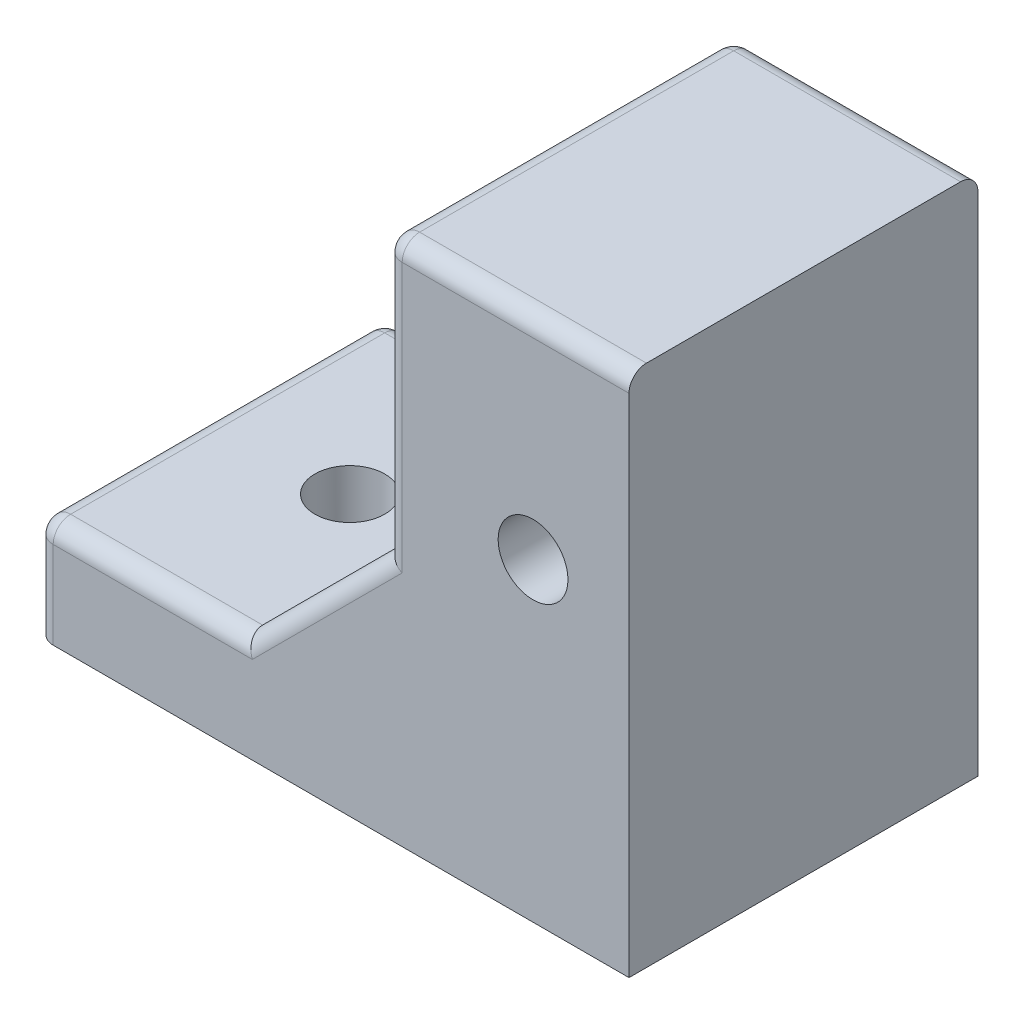
ISO-10303-21;
HEADER;
FILE_DESCRIPTION(('STEP AP214'),'2;1');
FILE_NAME('part.step','',(''),(''),'','','');
FILE_SCHEMA(('AUTOMOTIVE_DESIGN { 1 0 10303 214 1 1 1 1 }'));
ENDSEC;
DATA;
#1=APPLICATION_CONTEXT('core data for automotive mechanical design processes');
#2=APPLICATION_PROTOCOL_DEFINITION('international standard','automotive_design',2000,#1);
#3=PRODUCT_CONTEXT('',#1,'mechanical');
#4=PRODUCT('Part','Part','',(#3));
#5=PRODUCT_RELATED_PRODUCT_CATEGORY('part','',(#4));
#6=PRODUCT_DEFINITION_FORMATION('','',#4);
#7=PRODUCT_DEFINITION_CONTEXT('part definition',#1,'design');
#8=PRODUCT_DEFINITION('design','',#6,#7);
#9=PRODUCT_DEFINITION_SHAPE('','',#8);
#10=(LENGTH_UNIT() NAMED_UNIT(*) SI_UNIT(.MILLI.,.METRE.));
#11=(NAMED_UNIT(*) PLANE_ANGLE_UNIT() SI_UNIT($,.RADIAN.));
#12=(NAMED_UNIT(*) SI_UNIT($,.STERADIAN.) SOLID_ANGLE_UNIT());
#13=UNCERTAINTY_MEASURE_WITH_UNIT(LENGTH_MEASURE(1.E-05),#10,'distance_accuracy_value','');
#14=(GEOMETRIC_REPRESENTATION_CONTEXT(3) GLOBAL_UNCERTAINTY_ASSIGNED_CONTEXT((#13)) GLOBAL_UNIT_ASSIGNED_CONTEXT((#10,
#11,#12)) REPRESENTATION_CONTEXT('',''));
#15=CARTESIAN_POINT('',(0.,0.,0.));
#16=DIRECTION('',(0.,0.,1.));
#17=DIRECTION('',(1.,0.,0.));
#18=AXIS2_PLACEMENT_3D('',#15,#16,#17);
#19=CARTESIAN_POINT('',(-3.5,15.,-5.));
#20=DIRECTION('',(1.,0.,0.));
#21=DIRECTION('',(0.,0.,-1.));
#22=AXIS2_PLACEMENT_3D('',#19,#20,#21);
#23=PLANE('',#22);
#24=DIRECTION('',(0.,0.,1.));
#25=VECTOR('',#24,1.);
#26=CARTESIAN_POINT('',(-3.5,14.5,-5.));
#27=LINE('',#26,#25);
#28=CARTESIAN_POINT('',(-3.5,14.5,4.5));
#29=VERTEX_POINT('',#28);
#30=CARTESIAN_POINT('',(-3.5,14.5,-4.5));
#31=VERTEX_POINT('',#30);
#32=EDGE_CURVE('E252',#29,#31,#27,.F.);
#33=ORIENTED_EDGE('',*,*,#32,.T.);
#34=DIRECTION('',(0.,-1.,0.));
#35=VECTOR('',#34,1.);
#36=CARTESIAN_POINT('',(-3.5,6.99999999999996,-4.5));
#37=LINE('',#36,#35);
#38=CARTESIAN_POINT('',(-3.5,6.99999999999996,-4.5));
#39=VERTEX_POINT('',#38);
#40=EDGE_CURVE('E256',#31,#39,#37,.T.);
#41=ORIENTED_EDGE('',*,*,#40,.T.);
#42=DIRECTION('',(0.,0.,-1.));
#43=VECTOR('',#42,1.);
#44=CARTESIAN_POINT('',(-3.5,6.99999999999996,-3.));
#45=LINE('',#44,#43);
#46=CARTESIAN_POINT('',(-3.5,6.99999999999996,-3.));
#47=VERTEX_POINT('',#46);
#48=EDGE_CURVE('E173',#47,#39,#45,.T.);
#49=ORIENTED_EDGE('',*,*,#48,.F.);
#50=DIRECTION('',(0.,1.,0.));
#51=VECTOR('',#50,1.);
#52=CARTESIAN_POINT('',(-3.5,6.99999999999996,-3.));
#53=LINE('',#52,#51);
#54=CARTESIAN_POINT('',(-3.5,3.,-3.));
#55=VERTEX_POINT('',#54);
#56=EDGE_CURVE('E162',#55,#47,#53,.T.);
#57=ORIENTED_EDGE('',*,*,#56,.F.);
#58=DIRECTION('',(0.,0.,-1.));
#59=VECTOR('',#58,1.);
#60=CARTESIAN_POINT('',(-3.5,3.,-5.));
#61=LINE('',#60,#59);
#62=CARTESIAN_POINT('',(-3.5,3.,3.));
#63=VERTEX_POINT('',#62);
#64=EDGE_CURVE('E178',#63,#55,#61,.T.);
#65=ORIENTED_EDGE('',*,*,#64,.F.);
#66=DIRECTION('',(0.,1.,0.));
#67=VECTOR('',#66,1.);
#68=CARTESIAN_POINT('',(-3.5,6.99999999999996,3.));
#69=LINE('',#68,#67);
#70=CARTESIAN_POINT('',(-3.5,6.99999999999996,3.));
#71=VERTEX_POINT('',#70);
#72=EDGE_CURVE('E190',#63,#71,#69,.T.);
#73=ORIENTED_EDGE('',*,*,#72,.T.);
#74=DIRECTION('',(0.,0.,1.));
#75=VECTOR('',#74,1.);
#76=CARTESIAN_POINT('',(-3.5,6.99999999999996,3.));
#77=LINE('',#76,#75);
#78=CARTESIAN_POINT('',(-3.5,6.99999999999996,4.5));
#79=VERTEX_POINT('',#78);
#80=EDGE_CURVE('E195',#71,#79,#77,.T.);
#81=ORIENTED_EDGE('',*,*,#80,.T.);
#82=DIRECTION('',(0.,-1.,0.));
#83=VECTOR('',#82,1.);
#84=CARTESIAN_POINT('',(-3.5,15.,4.5));
#85=LINE('',#84,#83);
#86=EDGE_CURVE('E254',#79,#29,#85,.F.);
#87=ORIENTED_EDGE('',*,*,#86,.T.);
#88=EDGE_LOOP('',(#33,#41,#49,#57,#65,#73,#81,#87));
#89=FACE_BOUND('',#88,.T.);
#90=ADVANCED_FACE('F33',(#89),#23,.F.);
#91=CARTESIAN_POINT('',(-13.5,3.,-5.));
#92=DIRECTION('',(0.,-1.,0.));
#93=DIRECTION('',(0.,0.,-1.));
#94=AXIS2_PLACEMENT_3D('',#91,#92,#93);
#95=PLANE('',#94);
#96=CARTESIAN_POINT('',(-9.5,3.,0.));
#97=DIRECTION('',(0.,-1.,0.));
#98=DIRECTION('',(0.,0.,-1.));
#99=AXIS2_PLACEMENT_3D('',#96,#97,#98);
#100=CIRCLE('',#99,1.);
#101=CARTESIAN_POINT('',(-9.5,3.,-1.));
#102=VERTEX_POINT('',#101);
#103=EDGE_CURVE('E179',#102,#102,#100,.T.);
#104=ORIENTED_EDGE('',*,*,#103,.T.);
#105=EDGE_LOOP('',(#104));
#106=FACE_BOUND('',#105,.T.);
#107=DIRECTION('',(0.,0.,-1.));
#108=VECTOR('',#107,1.);
#109=CARTESIAN_POINT('',(-7.5,3.,-3.));
#110=LINE('',#109,#108);
#111=CARTESIAN_POINT('',(-7.5,3.,-3.));
#112=VERTEX_POINT('',#111);
#113=CARTESIAN_POINT('',(-7.5,3.,-4.5));
#114=VERTEX_POINT('',#113);
#115=EDGE_CURVE('E168',#112,#114,#110,.T.);
#116=ORIENTED_EDGE('',*,*,#115,.T.);
#117=DIRECTION('',(1.,0.,0.));
#118=VECTOR('',#117,1.);
#119=CARTESIAN_POINT('',(-13.5,3.,-4.5));
#120=LINE('',#119,#118);
#121=CARTESIAN_POINT('',(-13.,3.,-4.5));
#122=VERTEX_POINT('',#121);
#123=EDGE_CURVE('E264',#114,#122,#120,.F.);
#124=ORIENTED_EDGE('',*,*,#123,.T.);
#125=DIRECTION('',(0.,0.,-1.));
#126=VECTOR('',#125,1.);
#127=CARTESIAN_POINT('',(-13.,3.,-5.));
#128=LINE('',#127,#126);
#129=CARTESIAN_POINT('',(-13.,3.,4.5));
#130=VERTEX_POINT('',#129);
#131=EDGE_CURVE('E262',#122,#130,#128,.F.);
#132=ORIENTED_EDGE('',*,*,#131,.T.);
#133=DIRECTION('',(1.,0.,0.));
#134=VECTOR('',#133,1.);
#135=CARTESIAN_POINT('',(-13.5,3.,4.5));
#136=LINE('',#135,#134);
#137=CARTESIAN_POINT('',(-7.5,3.,4.5));
#138=VERTEX_POINT('',#137);
#139=EDGE_CURVE('E260',#130,#138,#136,.T.);
#140=ORIENTED_EDGE('',*,*,#139,.T.);
#141=DIRECTION('',(0.,0.,1.));
#142=VECTOR('',#141,1.);
#143=CARTESIAN_POINT('',(-7.5,3.,3.));
#144=LINE('',#143,#142);
#145=CARTESIAN_POINT('',(-7.5,3.,3.));
#146=VERTEX_POINT('',#145);
#147=EDGE_CURVE('E196',#146,#138,#144,.T.);
#148=ORIENTED_EDGE('',*,*,#147,.F.);
#149=DIRECTION('',(1.,0.,0.));
#150=VECTOR('',#149,1.);
#151=CARTESIAN_POINT('',(-3.5,3.,3.));
#152=LINE('',#151,#150);
#153=EDGE_CURVE('E187',#146,#63,#152,.T.);
#154=ORIENTED_EDGE('',*,*,#153,.T.);
#155=ORIENTED_EDGE('',*,*,#64,.T.);
#156=DIRECTION('',(1.,0.,0.));
#157=VECTOR('',#156,1.);
#158=CARTESIAN_POINT('',(-3.5,3.,-3.));
#159=LINE('',#158,#157);
#160=EDGE_CURVE('E160',#112,#55,#159,.T.);
#161=ORIENTED_EDGE('',*,*,#160,.F.);
#162=EDGE_LOOP('',(#116,#124,#132,#140,#148,#154,#155,#161));
#163=FACE_BOUND('',#162,.T.);
#164=ADVANCED_FACE('F176',(#106,#163),#95,.F.);
#165=CARTESIAN_POINT('',(-3.5,15.,5.));
#166=DIRECTION('',(0.,0.,-1.));
#167=DIRECTION('',(-1.,0.,0.));
#168=AXIS2_PLACEMENT_3D('',#165,#166,#167);
#169=PLANE('',#168);
#170=CARTESIAN_POINT('',(0.750000000000001,9.,5.));
#171=DIRECTION('',(0.,0.,-1.));
#172=DIRECTION('',(-1.,0.,0.));
#173=AXIS2_PLACEMENT_3D('',#170,#171,#172);
#174=CIRCLE('',#173,1.);
#175=CARTESIAN_POINT('',(-0.25,9.,5.));
#176=VERTEX_POINT('',#175);
#177=EDGE_CURVE('E326',#176,#176,#174,.T.);
#178=ORIENTED_EDGE('',*,*,#177,.T.);
#179=EDGE_LOOP('',(#178));
#180=FACE_BOUND('',#179,.T.);
#181=DIRECTION('',(1.,0.,0.));
#182=VECTOR('',#181,1.);
#183=CARTESIAN_POINT('',(-3.5,2.5,5.));
#184=LINE('',#183,#182);
#185=CARTESIAN_POINT('',(-7.29289321881345,2.5,5.));
#186=VERTEX_POINT('',#185);
#187=CARTESIAN_POINT('',(-13.,2.5,5.));
#188=VERTEX_POINT('',#187);
#189=EDGE_CURVE('E234',#186,#188,#184,.F.);
#190=ORIENTED_EDGE('',*,*,#189,.T.);
#191=DIRECTION('',(0.,1.,0.));
#192=VECTOR('',#191,1.);
#193=CARTESIAN_POINT('',(-13.,15.,5.));
#194=LINE('',#193,#192);
#195=CARTESIAN_POINT('',(-13.,0.,5.));
#196=VERTEX_POINT('',#195);
#197=EDGE_CURVE('E236',#188,#196,#194,.F.);
#198=ORIENTED_EDGE('',*,*,#197,.T.);
#199=DIRECTION('',(1.,0.,0.));
#200=VECTOR('',#199,1.);
#201=CARTESIAN_POINT('',(-3.5,0.,5.));
#202=LINE('',#201,#200);
#203=CARTESIAN_POINT('',(3.5,0.,5.));
#204=VERTEX_POINT('',#203);
#205=EDGE_CURVE('E204',#196,#204,#202,.T.);
#206=ORIENTED_EDGE('',*,*,#205,.T.);
#207=DIRECTION('',(0.,-1.,0.));
#208=VECTOR('',#207,1.);
#209=CARTESIAN_POINT('',(3.5,15.,5.));
#210=LINE('',#209,#208);
#211=CARTESIAN_POINT('',(3.5,14.5,5.));
#212=VERTEX_POINT('',#211);
#213=EDGE_CURVE('E219',#212,#204,#210,.T.);
#214=ORIENTED_EDGE('',*,*,#213,.F.);
#215=DIRECTION('',(1.,0.,0.));
#216=VECTOR('',#215,1.);
#217=CARTESIAN_POINT('',(-3.5,14.5,5.));
#218=LINE('',#217,#216);
#219=CARTESIAN_POINT('',(-3.,14.5,5.));
#220=VERTEX_POINT('',#219);
#221=EDGE_CURVE('E228',#212,#220,#218,.F.);
#222=ORIENTED_EDGE('',*,*,#221,.T.);
#223=DIRECTION('',(0.,-1.,0.));
#224=VECTOR('',#223,1.);
#225=CARTESIAN_POINT('',(-3.,15.,5.));
#226=LINE('',#225,#224);
#227=CARTESIAN_POINT('',(-3.,6.79289321881341,5.));
#228=VERTEX_POINT('',#227);
#229=EDGE_CURVE('E230',#220,#228,#226,.T.);
#230=ORIENTED_EDGE('',*,*,#229,.T.);
#231=DIRECTION('',(-0.707106781186551,-0.707106781186544,0.));
#232=VECTOR('',#231,1.);
#233=CARTESIAN_POINT('',(-7.14644660940673,2.64644660940672,5.));
#234=LINE('',#233,#232);
#235=EDGE_CURVE('E232',#228,#186,#234,.T.);
#236=ORIENTED_EDGE('',*,*,#235,.T.);
#237=EDGE_LOOP('',(#190,#198,#206,#214,#222,#230,#236));
#238=FACE_BOUND('',#237,.T.);
#239=ADVANCED_FACE('F346',(#180,#238),#169,.F.);
#240=CARTESIAN_POINT('',(3.5,15.,-5.));
#241=DIRECTION('',(1.,0.,0.));
#242=DIRECTION('',(0.,0.,-1.));
#243=AXIS2_PLACEMENT_3D('',#240,#241,#242);
#244=PLANE('',#243);
#245=DIRECTION('',(0.,-1.,0.));
#246=VECTOR('',#245,1.);
#247=CARTESIAN_POINT('',(3.5,15.,-5.));
#248=LINE('',#247,#246);
#249=CARTESIAN_POINT('',(3.5,14.5,-5.));
#250=VERTEX_POINT('',#249);
#251=CARTESIAN_POINT('',(3.5,0.,-5.));
#252=VERTEX_POINT('',#251);
#253=EDGE_CURVE('E209',#250,#252,#248,.T.);
#254=ORIENTED_EDGE('',*,*,#253,.F.);
#255=CARTESIAN_POINT('',(3.5,14.5,-4.5));
#256=DIRECTION('',(1.,0.,0.));
#257=DIRECTION('',(0.,0.,-1.));
#258=AXIS2_PLACEMENT_3D('',#255,#256,#257);
#259=CIRCLE('',#258,0.5);
#260=CARTESIAN_POINT('',(3.5,15.,-4.5));
#261=VERTEX_POINT('',#260);
#262=EDGE_CURVE('E270',#250,#261,#259,.T.);
#263=ORIENTED_EDGE('',*,*,#262,.T.);
#264=DIRECTION('',(0.,0.,1.));
#265=VECTOR('',#264,1.);
#266=CARTESIAN_POINT('',(3.5,15.,-5.));
#267=LINE('',#266,#265);
#268=CARTESIAN_POINT('',(3.5,15.,4.5));
#269=VERTEX_POINT('',#268);
#270=EDGE_CURVE('E206',#261,#269,#267,.T.);
#271=ORIENTED_EDGE('',*,*,#270,.T.);
#272=CARTESIAN_POINT('',(3.5,14.5,4.5));
#273=DIRECTION('',(1.,0.,0.));
#274=DIRECTION('',(0.,0.,-1.));
#275=AXIS2_PLACEMENT_3D('',#272,#273,#274);
#276=CIRCLE('',#275,0.5);
#277=EDGE_CURVE('E268',#269,#212,#276,.T.);
#278=ORIENTED_EDGE('',*,*,#277,.T.);
#279=ORIENTED_EDGE('',*,*,#213,.T.);
#280=DIRECTION('',(0.,0.,1.));
#281=VECTOR('',#280,1.);
#282=CARTESIAN_POINT('',(3.5,0.,-5.));
#283=LINE('',#282,#281);
#284=EDGE_CURVE('E213',#252,#204,#283,.T.);
#285=ORIENTED_EDGE('',*,*,#284,.F.);
#286=EDGE_LOOP('',(#254,#263,#271,#278,#279,#285));
#287=FACE_BOUND('',#286,.T.);
#288=ADVANCED_FACE('F352',(#287),#244,.T.);
#289=CARTESIAN_POINT('',(-3.5,15.,-5.));
#290=DIRECTION('',(0.,0.,-1.));
#291=DIRECTION('',(-1.,0.,0.));
#292=AXIS2_PLACEMENT_3D('',#289,#290,#291);
#293=PLANE('',#292);
#294=CARTESIAN_POINT('',(0.750000000000001,9.,-5.));
#295=DIRECTION('',(0.,0.,1.));
#296=DIRECTION('',(1.,0.,0.));
#297=AXIS2_PLACEMENT_3D('',#294,#295,#296);
#298=CIRCLE('',#297,1.);
#299=CARTESIAN_POINT('',(1.75,9.,-5.));
#300=VERTEX_POINT('',#299);
#301=EDGE_CURVE('E322',#300,#300,#298,.T.);
#302=ORIENTED_EDGE('',*,*,#301,.T.);
#303=EDGE_LOOP('',(#302));
#304=FACE_BOUND('',#303,.T.);
#305=DIRECTION('',(1.,0.,0.));
#306=VECTOR('',#305,1.);
#307=CARTESIAN_POINT('',(-3.5,0.,-5.));
#308=LINE('',#307,#306);
#309=CARTESIAN_POINT('',(-13.,0.,-5.));
#310=VERTEX_POINT('',#309);
#311=EDGE_CURVE('E210',#310,#252,#308,.T.);
#312=ORIENTED_EDGE('',*,*,#311,.F.);
#313=DIRECTION('',(0.,-1.,0.));
#314=VECTOR('',#313,1.);
#315=CARTESIAN_POINT('',(-13.,3.,-5.));
#316=LINE('',#315,#314);
#317=CARTESIAN_POINT('',(-13.,2.5,-5.));
#318=VERTEX_POINT('',#317);
#319=EDGE_CURVE('E250',#310,#318,#316,.F.);
#320=ORIENTED_EDGE('',*,*,#319,.T.);
#321=DIRECTION('',(1.,0.,0.));
#322=VECTOR('',#321,1.);
#323=CARTESIAN_POINT('',(-7.5,2.5,-5.));
#324=LINE('',#323,#322);
#325=CARTESIAN_POINT('',(-7.29289321881345,2.5,-5.));
#326=VERTEX_POINT('',#325);
#327=EDGE_CURVE('E248',#318,#326,#324,.T.);
#328=ORIENTED_EDGE('',*,*,#327,.T.);
#329=DIRECTION('',(-0.707106781186551,-0.707106781186544,0.));
#330=VECTOR('',#329,1.);
#331=CARTESIAN_POINT('',(-3.14644660940673,6.64644660940668,-5.));
#332=LINE('',#331,#330);
#333=CARTESIAN_POINT('',(-3.,6.79289321881341,-5.));
#334=VERTEX_POINT('',#333);
#335=EDGE_CURVE('E246',#326,#334,#332,.F.);
#336=ORIENTED_EDGE('',*,*,#335,.T.);
#337=DIRECTION('',(0.,-1.,0.));
#338=VECTOR('',#337,1.);
#339=CARTESIAN_POINT('',(-3.,15.,-5.));
#340=LINE('',#339,#338);
#341=CARTESIAN_POINT('',(-3.,14.5,-5.));
#342=VERTEX_POINT('',#341);
#343=EDGE_CURVE('E244',#334,#342,#340,.F.);
#344=ORIENTED_EDGE('',*,*,#343,.T.);
#345=DIRECTION('',(1.,0.,0.));
#346=VECTOR('',#345,1.);
#347=CARTESIAN_POINT('',(-3.5,14.5,-5.));
#348=LINE('',#347,#346);
#349=EDGE_CURVE('E242',#342,#250,#348,.T.);
#350=ORIENTED_EDGE('',*,*,#349,.T.);
#351=ORIENTED_EDGE('',*,*,#253,.T.);
#352=EDGE_LOOP('',(#312,#320,#328,#336,#344,#350,#351));
#353=FACE_BOUND('',#352,.T.);
#354=ADVANCED_FACE('F364',(#304,#353),#293,.T.);
#355=CARTESIAN_POINT('',(0.,15.,0.));
#356=DIRECTION('',(0.,1.,0.));
#357=DIRECTION('',(0.,0.,1.));
#358=AXIS2_PLACEMENT_3D('',#355,#356,#357);
#359=PLANE('',#358);
#360=ORIENTED_EDGE('',*,*,#270,.F.);
#361=DIRECTION('',(1.,0.,0.));
#362=VECTOR('',#361,1.);
#363=CARTESIAN_POINT('',(0.,15.,-4.5));
#364=LINE('',#363,#362);
#365=CARTESIAN_POINT('',(-3.,15.,-4.5));
#366=VERTEX_POINT('',#365);
#367=EDGE_CURVE('E11',#261,#366,#364,.F.);
#368=ORIENTED_EDGE('',*,*,#367,.T.);
#369=DIRECTION('',(0.,0.,1.));
#370=VECTOR('',#369,1.);
#371=CARTESIAN_POINT('',(-3.,15.,5.));
#372=LINE('',#371,#370);
#373=CARTESIAN_POINT('',(-3.,15.,4.5));
#374=VERTEX_POINT('',#373);
#375=EDGE_CURVE('E42',#366,#374,#372,.T.);
#376=ORIENTED_EDGE('',*,*,#375,.T.);
#377=DIRECTION('',(1.,0.,0.));
#378=VECTOR('',#377,1.);
#379=CARTESIAN_POINT('',(3.5,15.,4.5));
#380=LINE('',#379,#378);
#381=EDGE_CURVE('E272',#374,#269,#380,.T.);
#382=ORIENTED_EDGE('',*,*,#381,.T.);
#383=EDGE_LOOP('',(#360,#368,#376,#382));
#384=FACE_BOUND('',#383,.T.);
#385=ADVANCED_FACE('F361',(#384),#359,.T.);
#386=CARTESIAN_POINT('',(0.,0.,0.));
#387=DIRECTION('',(0.,1.,0.));
#388=DIRECTION('',(0.,0.,1.));
#389=AXIS2_PLACEMENT_3D('',#386,#387,#388);
#390=PLANE('',#389);
#391=CARTESIAN_POINT('',(-9.5,0.,0.));
#392=DIRECTION('',(0.,1.,0.));
#393=DIRECTION('',(0.,0.,1.));
#394=AXIS2_PLACEMENT_3D('',#391,#392,#393);
#395=CIRCLE('',#394,1.);
#396=CARTESIAN_POINT('',(-9.5,0.,1.));
#397=VERTEX_POINT('',#396);
#398=EDGE_CURVE('E182',#397,#397,#395,.T.);
#399=ORIENTED_EDGE('',*,*,#398,.T.);
#400=EDGE_LOOP('',(#399));
#401=FACE_BOUND('',#400,.T.);
#402=ORIENTED_EDGE('',*,*,#205,.F.);
#403=CARTESIAN_POINT('',(-13.,0.,4.5));
#404=DIRECTION('',(0.,1.,0.));
#405=DIRECTION('',(0.,0.,1.));
#406=AXIS2_PLACEMENT_3D('',#403,#404,#405);
#407=CIRCLE('',#406,0.5);
#408=CARTESIAN_POINT('',(-13.5,0.,4.5));
#409=VERTEX_POINT('',#408);
#410=EDGE_CURVE('E240',#196,#409,#407,.F.);
#411=ORIENTED_EDGE('',*,*,#410,.T.);
#412=DIRECTION('',(0.,0.,1.));
#413=VECTOR('',#412,1.);
#414=CARTESIAN_POINT('',(-13.5,0.,-5.));
#415=LINE('',#414,#413);
#416=CARTESIAN_POINT('',(-13.5,0.,-4.5));
#417=VERTEX_POINT('',#416);
#418=EDGE_CURVE('E201',#417,#409,#415,.T.);
#419=ORIENTED_EDGE('',*,*,#418,.F.);
#420=CARTESIAN_POINT('',(-13.,0.,-4.5));
#421=DIRECTION('',(0.,1.,0.));
#422=DIRECTION('',(0.,0.,1.));
#423=AXIS2_PLACEMENT_3D('',#420,#421,#422);
#424=CIRCLE('',#423,0.5);
#425=EDGE_CURVE('E238',#417,#310,#424,.F.);
#426=ORIENTED_EDGE('',*,*,#425,.T.);
#427=ORIENTED_EDGE('',*,*,#311,.T.);
#428=ORIENTED_EDGE('',*,*,#284,.T.);
#429=EDGE_LOOP('',(#402,#411,#419,#426,#427,#428));
#430=FACE_BOUND('',#429,.T.);
#431=ADVANCED_FACE('F335',(#401,#430),#390,.F.);
#432=CARTESIAN_POINT('',(-13.5,0.,0.));
#433=DIRECTION('',(1.,0.,0.));
#434=DIRECTION('',(0.,0.,-1.));
#435=AXIS2_PLACEMENT_3D('',#432,#433,#434);
#436=PLANE('',#435);
#437=ORIENTED_EDGE('',*,*,#418,.T.);
#438=DIRECTION('',(0.,1.,0.));
#439=VECTOR('',#438,1.);
#440=CARTESIAN_POINT('',(-13.5,0.,4.5));
#441=LINE('',#440,#439);
#442=CARTESIAN_POINT('',(-13.5,2.5,4.5));
#443=VERTEX_POINT('',#442);
#444=EDGE_CURVE('E225',#409,#443,#441,.T.);
#445=ORIENTED_EDGE('',*,*,#444,.T.);
#446=DIRECTION('',(0.,0.,-1.));
#447=VECTOR('',#446,1.);
#448=CARTESIAN_POINT('',(-13.5,2.5,0.));
#449=LINE('',#448,#447);
#450=CARTESIAN_POINT('',(-13.5,2.5,-4.5));
#451=VERTEX_POINT('',#450);
#452=EDGE_CURVE('E221',#443,#451,#449,.T.);
#453=ORIENTED_EDGE('',*,*,#452,.T.);
#454=DIRECTION('',(0.,-1.,0.));
#455=VECTOR('',#454,1.);
#456=CARTESIAN_POINT('',(-13.5,0.,-4.5));
#457=LINE('',#456,#455);
#458=EDGE_CURVE('E223',#451,#417,#457,.T.);
#459=ORIENTED_EDGE('',*,*,#458,.T.);
#460=EDGE_LOOP('',(#437,#445,#453,#459));
#461=FACE_BOUND('',#460,.T.);
#462=ADVANCED_FACE('F359',(#461),#436,.F.);
#463=CARTESIAN_POINT('',(-7.5,3.,3.));
#464=DIRECTION('',(-0.707106781186544,0.707106781186551,0.));
#465=DIRECTION('',(-0.707106781186551,-0.707106781186544,0.));
#466=AXIS2_PLACEMENT_3D('',#463,#464,#465);
#467=PLANE('',#466);
#468=ORIENTED_EDGE('',*,*,#147,.T.);
#469=DIRECTION('',(-0.707106781186551,-0.707106781186544,0.));
#470=VECTOR('',#469,1.);
#471=CARTESIAN_POINT('',(-3.5,6.99999999999996,4.5));
#472=LINE('',#471,#470);
#473=EDGE_CURVE('E266',#138,#79,#472,.F.);
#474=ORIENTED_EDGE('',*,*,#473,.T.);
#475=ORIENTED_EDGE('',*,*,#80,.F.);
#476=DIRECTION('',(-0.707106781186551,-0.707106781186544,0.));
#477=VECTOR('',#476,1.);
#478=CARTESIAN_POINT('',(-7.5,3.,3.));
#479=LINE('',#478,#477);
#480=EDGE_CURVE('E192',#71,#146,#479,.T.);
#481=ORIENTED_EDGE('',*,*,#480,.T.);
#482=EDGE_LOOP('',(#468,#474,#475,#481));
#483=FACE_BOUND('',#482,.T.);
#484=ADVANCED_FACE('F472',(#483),#467,.T.);
#485=CARTESIAN_POINT('',(0.,0.,3.));
#486=DIRECTION('',(0.,0.,1.));
#487=DIRECTION('',(1.,0.,0.));
#488=AXIS2_PLACEMENT_3D('',#485,#486,#487);
#489=PLANE('',#488);
#490=ORIENTED_EDGE('',*,*,#153,.F.);
#491=ORIENTED_EDGE('',*,*,#480,.F.);
#492=ORIENTED_EDGE('',*,*,#72,.F.);
#493=EDGE_LOOP('',(#490,#491,#492));
#494=FACE_BOUND('',#493,.T.);
#495=ADVANCED_FACE('F477',(#494),#489,.F.);
#496=CARTESIAN_POINT('',(-7.5,3.,-3.));
#497=DIRECTION('',(0.707106781186544,-0.707106781186551,0.));
#498=DIRECTION('',(0.707106781186551,0.707106781186544,0.));
#499=AXIS2_PLACEMENT_3D('',#496,#497,#498);
#500=PLANE('',#499);
#501=ORIENTED_EDGE('',*,*,#48,.T.);
#502=DIRECTION('',(-0.707106781186551,-0.707106781186544,0.));
#503=VECTOR('',#502,1.);
#504=CARTESIAN_POINT('',(-7.5,3.,-4.5));
#505=LINE('',#504,#503);
#506=EDGE_CURVE('E170',#39,#114,#505,.T.);
#507=ORIENTED_EDGE('',*,*,#506,.T.);
#508=ORIENTED_EDGE('',*,*,#115,.F.);
#509=DIRECTION('',(-0.707106781186551,-0.707106781186544,0.));
#510=VECTOR('',#509,1.);
#511=CARTESIAN_POINT('',(-7.5,3.,-3.));
#512=LINE('',#511,#510);
#513=EDGE_CURVE('E156',#47,#112,#512,.T.);
#514=ORIENTED_EDGE('',*,*,#513,.F.);
#515=EDGE_LOOP('',(#501,#507,#508,#514));
#516=FACE_BOUND('',#515,.T.);
#517=ADVANCED_FACE('F169',(#516),#500,.F.);
#518=CARTESIAN_POINT('',(0.,0.,-3.));
#519=DIRECTION('',(0.,0.,-1.));
#520=DIRECTION('',(1.,0.,0.));
#521=AXIS2_PLACEMENT_3D('',#518,#519,#520);
#522=PLANE('',#521);
#523=ORIENTED_EDGE('',*,*,#160,.T.);
#524=ORIENTED_EDGE('',*,*,#56,.T.);
#525=ORIENTED_EDGE('',*,*,#513,.T.);
#526=EDGE_LOOP('',(#523,#524,#525));
#527=FACE_BOUND('',#526,.T.);
#528=ADVANCED_FACE('F158',(#527),#522,.F.);
#529=CARTESIAN_POINT('',(-9.5,0.,0.));
#530=DIRECTION('',(0.,1.,0.));
#531=DIRECTION('',(0.,0.,1.));
#532=AXIS2_PLACEMENT_3D('',#529,#530,#531);
#533=CYLINDRICAL_SURFACE('',#532,1.);
#534=ORIENTED_EDGE('',*,*,#398,.F.);
#535=EDGE_LOOP('',(#534));
#536=FACE_BOUND('',#535,.T.);
#537=ORIENTED_EDGE('',*,*,#103,.F.);
#538=EDGE_LOOP('',(#537));
#539=FACE_BOUND('',#538,.T.);
#540=ADVANCED_FACE('F338',(#536,#539),#533,.F.);
#541=CARTESIAN_POINT('',(0.750000000000001,9.,-5.));
#542=DIRECTION('',(0.,0.,1.));
#543=DIRECTION('',(1.,0.,0.));
#544=AXIS2_PLACEMENT_3D('',#541,#542,#543);
#545=CYLINDRICAL_SURFACE('',#544,1.);
#546=ORIENTED_EDGE('',*,*,#301,.F.);
#547=EDGE_LOOP('',(#546));
#548=FACE_BOUND('',#547,.T.);
#549=ORIENTED_EDGE('',*,*,#177,.F.);
#550=EDGE_LOOP('',(#549));
#551=FACE_BOUND('',#550,.T.);
#552=ADVANCED_FACE('F341',(#548,#551),#545,.F.);
#553=CARTESIAN_POINT('',(-3.5,14.5,-4.5));
#554=DIRECTION('',(1.,0.,0.));
#555=DIRECTION('',(0.,0.,-1.));
#556=AXIS2_PLACEMENT_3D('',#553,#554,#555);
#557=CYLINDRICAL_SURFACE('',#556,0.5);
#558=CARTESIAN_POINT('',(-3.,14.5,-4.5));
#559=DIRECTION('',(-1.,0.,0.));
#560=DIRECTION('',(0.,0.,1.));
#561=AXIS2_PLACEMENT_3D('',#558,#559,#560);
#562=CIRCLE('',#561,0.5);
#563=EDGE_CURVE('E37',#366,#342,#562,.T.);
#564=ORIENTED_EDGE('',*,*,#563,.F.);
#565=ORIENTED_EDGE('',*,*,#367,.F.);
#566=ORIENTED_EDGE('',*,*,#262,.F.);
#567=ORIENTED_EDGE('',*,*,#349,.F.);
#568=EDGE_LOOP('',(#564,#565,#566,#567));
#569=FACE_BOUND('',#568,.T.);
#570=ADVANCED_FACE('F35',(#569),#557,.T.);
#571=CARTESIAN_POINT('',(-3.,14.5,-4.5));
#572=DIRECTION('',(0.,0.,1.));
#573=DIRECTION('',(1.,0.,0.));
#574=AXIS2_PLACEMENT_3D('',#571,#572,#573);
#575=SPHERICAL_SURFACE('',#574,0.5);
#576=CARTESIAN_POINT('',(-3.,14.5,-4.5));
#577=DIRECTION('',(0.,0.,-1.));
#578=DIRECTION('',(-1.,0.,0.));
#579=AXIS2_PLACEMENT_3D('',#576,#577,#578);
#580=CIRCLE('',#579,0.5);
#581=EDGE_CURVE('E313',#366,#31,#580,.F.);
#582=ORIENTED_EDGE('',*,*,#581,.F.);
#583=ORIENTED_EDGE('',*,*,#563,.T.);
#584=CARTESIAN_POINT('',(-3.,14.5,-4.5));
#585=DIRECTION('',(0.,1.,0.));
#586=DIRECTION('',(0.,0.,1.));
#587=AXIS2_PLACEMENT_3D('',#584,#585,#586);
#588=CIRCLE('',#587,0.5);
#589=EDGE_CURVE('E315',#31,#342,#588,.F.);
#590=ORIENTED_EDGE('',*,*,#589,.F.);
#591=EDGE_LOOP('',(#582,#583,#590));
#592=FACE_BOUND('',#591,.T.);
#593=ADVANCED_FACE('F426',(#592),#575,.T.);
#594=CARTESIAN_POINT('',(-3.,15.,-4.5));
#595=DIRECTION('',(0.,1.,0.));
#596=DIRECTION('',(0.,0.,1.));
#597=AXIS2_PLACEMENT_3D('',#594,#595,#596);
#598=CYLINDRICAL_SURFACE('',#597,0.5);
#599=ORIENTED_EDGE('',*,*,#589,.T.);
#600=ORIENTED_EDGE('',*,*,#343,.F.);
#601=CARTESIAN_POINT('',(-3.,6.79289321881341,-4.5));
#602=DIRECTION('',(0.382683432365092,0.923879532511286,0.));
#603=DIRECTION('',(-0.923879532511286,0.382683432365092,0.));
#604=AXIS2_PLACEMENT_3D('',#601,#602,#603);
#605=ELLIPSE('',#604,0.541196100146198,0.5);
#606=EDGE_CURVE('E310',#39,#334,#605,.F.);
#607=ORIENTED_EDGE('',*,*,#606,.F.);
#608=ORIENTED_EDGE('',*,*,#40,.F.);
#609=EDGE_LOOP('',(#599,#600,#607,#608));
#610=FACE_BOUND('',#609,.T.);
#611=ADVANCED_FACE('F423',(#610),#598,.T.);
#612=CARTESIAN_POINT('',(-3.,14.5,0.));
#613=DIRECTION('',(0.,0.,-1.));
#614=DIRECTION('',(-1.,0.,0.));
#615=AXIS2_PLACEMENT_3D('',#612,#613,#614);
#616=CYLINDRICAL_SURFACE('',#615,0.5);
#617=ORIENTED_EDGE('',*,*,#581,.T.);
#618=ORIENTED_EDGE('',*,*,#32,.F.);
#619=CARTESIAN_POINT('',(-3.,14.5,4.5));
#620=DIRECTION('',(0.,0.,1.));
#621=DIRECTION('',(1.,0.,0.));
#622=AXIS2_PLACEMENT_3D('',#619,#620,#621);
#623=CIRCLE('',#622,0.5);
#624=EDGE_CURVE('E307',#374,#29,#623,.T.);
#625=ORIENTED_EDGE('',*,*,#624,.F.);
#626=ORIENTED_EDGE('',*,*,#375,.F.);
#627=EDGE_LOOP('',(#617,#618,#625,#626));
#628=FACE_BOUND('',#627,.T.);
#629=ADVANCED_FACE('F419',(#628),#616,.T.);
#630=CARTESIAN_POINT('',(0.,14.5,4.5));
#631=DIRECTION('',(-1.,0.,0.));
#632=DIRECTION('',(0.,0.,1.));
#633=AXIS2_PLACEMENT_3D('',#630,#631,#632);
#634=CYLINDRICAL_SURFACE('',#633,0.5);
#635=ORIENTED_EDGE('',*,*,#277,.F.);
#636=ORIENTED_EDGE('',*,*,#381,.F.);
#637=CARTESIAN_POINT('',(-3.,14.5,4.5));
#638=DIRECTION('',(-1.,0.,0.));
#639=DIRECTION('',(0.,0.,1.));
#640=AXIS2_PLACEMENT_3D('',#637,#638,#639);
#641=CIRCLE('',#640,0.5);
#642=EDGE_CURVE('E304',#220,#374,#641,.T.);
#643=ORIENTED_EDGE('',*,*,#642,.F.);
#644=ORIENTED_EDGE('',*,*,#221,.F.);
#645=EDGE_LOOP('',(#635,#636,#643,#644));
#646=FACE_BOUND('',#645,.T.);
#647=ADVANCED_FACE('F415',(#646),#634,.T.);
#648=CARTESIAN_POINT('',(-7.14644660940673,2.64644660940672,-4.5));
#649=DIRECTION('',(0.707106781186551,0.707106781186544,0.));
#650=DIRECTION('',(-0.707106781186544,0.707106781186551,0.));
#651=AXIS2_PLACEMENT_3D('',#648,#649,#650);
#652=CYLINDRICAL_SURFACE('',#651,0.5);
#653=ORIENTED_EDGE('',*,*,#606,.T.);
#654=ORIENTED_EDGE('',*,*,#335,.F.);
#655=CARTESIAN_POINT('',(-7.29289321881345,2.5,-4.5));
#656=DIRECTION('',(0.923879532511288,0.382683432365087,0.));
#657=DIRECTION('',(-0.382683432365087,0.923879532511288,0.));
#658=AXIS2_PLACEMENT_3D('',#655,#656,#657);
#659=ELLIPSE('',#658,0.541196100146196,0.5);
#660=EDGE_CURVE('E301',#114,#326,#659,.F.);
#661=ORIENTED_EDGE('',*,*,#660,.F.);
#662=ORIENTED_EDGE('',*,*,#506,.F.);
#663=EDGE_LOOP('',(#653,#654,#661,#662));
#664=FACE_BOUND('',#663,.T.);
#665=ADVANCED_FACE('F411',(#664),#652,.T.);
#666=CARTESIAN_POINT('',(-3.,14.5,4.5));
#667=DIRECTION('',(0.,0.,1.));
#668=DIRECTION('',(1.,0.,0.));
#669=AXIS2_PLACEMENT_3D('',#666,#667,#668);
#670=SPHERICAL_SURFACE('',#669,0.5);
#671=ORIENTED_EDGE('',*,*,#642,.T.);
#672=ORIENTED_EDGE('',*,*,#624,.T.);
#673=CARTESIAN_POINT('',(-3.,14.5,4.5));
#674=DIRECTION('',(0.,1.,0.));
#675=DIRECTION('',(0.,0.,1.));
#676=AXIS2_PLACEMENT_3D('',#673,#674,#675);
#677=CIRCLE('',#676,0.5);
#678=EDGE_CURVE('E298',#220,#29,#677,.F.);
#679=ORIENTED_EDGE('',*,*,#678,.F.);
#680=EDGE_LOOP('',(#671,#672,#679));
#681=FACE_BOUND('',#680,.T.);
#682=ADVANCED_FACE('F407',(#681),#670,.T.);
#683=CARTESIAN_POINT('',(-13.,0.,-4.5));
#684=DIRECTION('',(0.,1.,0.));
#685=DIRECTION('',(0.,0.,1.));
#686=AXIS2_PLACEMENT_3D('',#683,#684,#685);
#687=CYLINDRICAL_SURFACE('',#686,0.5);
#688=ORIENTED_EDGE('',*,*,#425,.F.);
#689=ORIENTED_EDGE('',*,*,#458,.F.);
#690=CARTESIAN_POINT('',(-13.,2.5,-4.5));
#691=DIRECTION('',(0.,1.,0.));
#692=DIRECTION('',(-1.,0.,0.));
#693=AXIS2_PLACEMENT_3D('',#690,#691,#692);
#694=CIRCLE('',#693,0.5);
#695=EDGE_CURVE('E295',#318,#451,#694,.T.);
#696=ORIENTED_EDGE('',*,*,#695,.F.);
#697=ORIENTED_EDGE('',*,*,#319,.F.);
#698=EDGE_LOOP('',(#688,#689,#696,#697));
#699=FACE_BOUND('',#698,.T.);
#700=ADVANCED_FACE('F403',(#699),#687,.T.);
#701=CARTESIAN_POINT('',(-3.5,2.5,-4.5));
#702=DIRECTION('',(-1.,0.,0.));
#703=DIRECTION('',(0.,0.,1.));
#704=AXIS2_PLACEMENT_3D('',#701,#702,#703);
#705=CYLINDRICAL_SURFACE('',#704,0.5);
#706=ORIENTED_EDGE('',*,*,#660,.T.);
#707=ORIENTED_EDGE('',*,*,#327,.F.);
#708=CARTESIAN_POINT('',(-13.,2.5,-4.5));
#709=DIRECTION('',(-1.,0.,0.));
#710=DIRECTION('',(0.,0.,1.));
#711=AXIS2_PLACEMENT_3D('',#708,#709,#710);
#712=CIRCLE('',#711,0.5);
#713=EDGE_CURVE('E292',#122,#318,#712,.T.);
#714=ORIENTED_EDGE('',*,*,#713,.F.);
#715=ORIENTED_EDGE('',*,*,#123,.F.);
#716=EDGE_LOOP('',(#706,#707,#714,#715));
#717=FACE_BOUND('',#716,.T.);
#718=ADVANCED_FACE('F399',(#717),#705,.T.);
#719=CARTESIAN_POINT('',(-3.,15.,4.5));
#720=DIRECTION('',(0.,-1.,0.));
#721=DIRECTION('',(0.,0.,-1.));
#722=AXIS2_PLACEMENT_3D('',#719,#720,#721);
#723=CYLINDRICAL_SURFACE('',#722,0.5);
#724=ORIENTED_EDGE('',*,*,#678,.T.);
#725=ORIENTED_EDGE('',*,*,#86,.F.);
#726=CARTESIAN_POINT('',(-3.,6.79289321881341,4.5));
#727=DIRECTION('',(-0.382683432365092,-0.923879532511286,0.));
#728=DIRECTION('',(0.923879532511286,-0.382683432365092,0.));
#729=AXIS2_PLACEMENT_3D('',#726,#727,#728);
#730=ELLIPSE('',#729,0.541196100146198,0.5);
#731=EDGE_CURVE('E289',#228,#79,#730,.T.);
#732=ORIENTED_EDGE('',*,*,#731,.F.);
#733=ORIENTED_EDGE('',*,*,#229,.F.);
#734=EDGE_LOOP('',(#724,#725,#732,#733));
#735=FACE_BOUND('',#734,.T.);
#736=ADVANCED_FACE('F395',(#735),#723,.T.);
#737=CARTESIAN_POINT('',(-13.,2.5,-4.5));
#738=DIRECTION('',(0.,0.,1.));
#739=DIRECTION('',(1.,0.,0.));
#740=AXIS2_PLACEMENT_3D('',#737,#738,#739);
#741=SPHERICAL_SURFACE('',#740,0.5);
#742=ORIENTED_EDGE('',*,*,#713,.T.);
#743=ORIENTED_EDGE('',*,*,#695,.T.);
#744=CARTESIAN_POINT('',(-13.,2.5,-4.5));
#745=DIRECTION('',(0.,0.,-1.));
#746=DIRECTION('',(-1.,0.,0.));
#747=AXIS2_PLACEMENT_3D('',#744,#745,#746);
#748=CIRCLE('',#747,0.5);
#749=EDGE_CURVE('E286',#122,#451,#748,.F.);
#750=ORIENTED_EDGE('',*,*,#749,.F.);
#751=EDGE_LOOP('',(#742,#743,#750));
#752=FACE_BOUND('',#751,.T.);
#753=ADVANCED_FACE('F391',(#752),#741,.T.);
#754=CARTESIAN_POINT('',(0.853553390593294,10.6464466094067,4.5));
#755=DIRECTION('',(0.707106781186551,0.707106781186544,0.));
#756=DIRECTION('',(-0.707106781186544,0.707106781186551,0.));
#757=AXIS2_PLACEMENT_3D('',#754,#755,#756);
#758=CYLINDRICAL_SURFACE('',#757,0.5);
#759=ORIENTED_EDGE('',*,*,#731,.T.);
#760=ORIENTED_EDGE('',*,*,#473,.F.);
#761=CARTESIAN_POINT('',(-7.29289321881345,2.5,4.5));
#762=DIRECTION('',(0.923879532511288,0.382683432365087,0.));
#763=DIRECTION('',(0.382683432365087,-0.923879532511288,0.));
#764=AXIS2_PLACEMENT_3D('',#761,#762,#763);
#765=ELLIPSE('',#764,0.541196100146196,0.5);
#766=EDGE_CURVE('E283',#186,#138,#765,.F.);
#767=ORIENTED_EDGE('',*,*,#766,.F.);
#768=ORIENTED_EDGE('',*,*,#235,.F.);
#769=EDGE_LOOP('',(#759,#760,#767,#768));
#770=FACE_BOUND('',#769,.T.);
#771=ADVANCED_FACE('F387',(#770),#758,.T.);
#772=CARTESIAN_POINT('',(-13.,2.5,0.));
#773=DIRECTION('',(0.,0.,-1.));
#774=DIRECTION('',(0.,1.,0.));
#775=AXIS2_PLACEMENT_3D('',#772,#773,#774);
#776=CYLINDRICAL_SURFACE('',#775,0.5);
#777=ORIENTED_EDGE('',*,*,#749,.T.);
#778=ORIENTED_EDGE('',*,*,#452,.F.);
#779=CARTESIAN_POINT('',(-13.,2.5,4.5));
#780=DIRECTION('',(0.,0.,1.));
#781=DIRECTION('',(1.,0.,0.));
#782=AXIS2_PLACEMENT_3D('',#779,#780,#781);
#783=CIRCLE('',#782,0.5);
#784=EDGE_CURVE('E280',#130,#443,#783,.T.);
#785=ORIENTED_EDGE('',*,*,#784,.F.);
#786=ORIENTED_EDGE('',*,*,#131,.F.);
#787=EDGE_LOOP('',(#777,#778,#785,#786));
#788=FACE_BOUND('',#787,.T.);
#789=ADVANCED_FACE('F383',(#788),#776,.T.);
#790=CARTESIAN_POINT('',(-13.5,2.5,4.5));
#791=DIRECTION('',(1.,0.,0.));
#792=DIRECTION('',(0.,0.,-1.));
#793=AXIS2_PLACEMENT_3D('',#790,#791,#792);
#794=CYLINDRICAL_SURFACE('',#793,0.5);
#795=ORIENTED_EDGE('',*,*,#766,.T.);
#796=ORIENTED_EDGE('',*,*,#139,.F.);
#797=CARTESIAN_POINT('',(-13.,2.5,4.5));
#798=DIRECTION('',(-1.,0.,0.));
#799=DIRECTION('',(0.,0.,1.));
#800=AXIS2_PLACEMENT_3D('',#797,#798,#799);
#801=CIRCLE('',#800,0.5);
#802=EDGE_CURVE('E277',#188,#130,#801,.T.);
#803=ORIENTED_EDGE('',*,*,#802,.F.);
#804=ORIENTED_EDGE('',*,*,#189,.F.);
#805=EDGE_LOOP('',(#795,#796,#803,#804));
#806=FACE_BOUND('',#805,.T.);
#807=ADVANCED_FACE('F379',(#806),#794,.T.);
#808=CARTESIAN_POINT('',(-13.,2.5,4.5));
#809=DIRECTION('',(0.,0.,1.));
#810=DIRECTION('',(1.,0.,0.));
#811=AXIS2_PLACEMENT_3D('',#808,#809,#810);
#812=SPHERICAL_SURFACE('',#811,0.5);
#813=ORIENTED_EDGE('',*,*,#802,.T.);
#814=ORIENTED_EDGE('',*,*,#784,.T.);
#815=CARTESIAN_POINT('',(-13.,2.5,4.5));
#816=DIRECTION('',(0.,1.,0.));
#817=DIRECTION('',(0.,0.,1.));
#818=AXIS2_PLACEMENT_3D('',#815,#816,#817);
#819=CIRCLE('',#818,0.5);
#820=EDGE_CURVE('E275',#188,#443,#819,.F.);
#821=ORIENTED_EDGE('',*,*,#820,.F.);
#822=EDGE_LOOP('',(#813,#814,#821));
#823=FACE_BOUND('',#822,.T.);
#824=ADVANCED_FACE('F375',(#823),#812,.T.);
#825=CARTESIAN_POINT('',(-13.,0.,4.5));
#826=DIRECTION('',(0.,1.,0.));
#827=DIRECTION('',(0.,0.,1.));
#828=AXIS2_PLACEMENT_3D('',#825,#826,#827);
#829=CYLINDRICAL_SURFACE('',#828,0.5);
#830=ORIENTED_EDGE('',*,*,#410,.F.);
#831=ORIENTED_EDGE('',*,*,#197,.F.);
#832=ORIENTED_EDGE('',*,*,#820,.T.);
#833=ORIENTED_EDGE('',*,*,#444,.F.);
#834=EDGE_LOOP('',(#830,#831,#832,#833));
#835=FACE_BOUND('',#834,.T.);
#836=ADVANCED_FACE('F372',(#835),#829,.T.);
#837=CLOSED_SHELL('',(#90,#164,#239,#288,#354,#385,#431,#462,#484,#495,#517,#528,#540,#552,#570,
#593,#611,#629,#647,#665,#682,#700,#718,#736,#753,#771,#789,#807,#824,#836));
#838=MANIFOLD_SOLID_BREP('B2',#837);
#839=ADVANCED_BREP_SHAPE_REPRESENTATION('',(#18,#838),#14);
#840=SHAPE_DEFINITION_REPRESENTATION(#9,#839);
ENDSEC;
END-ISO-10303-21;
